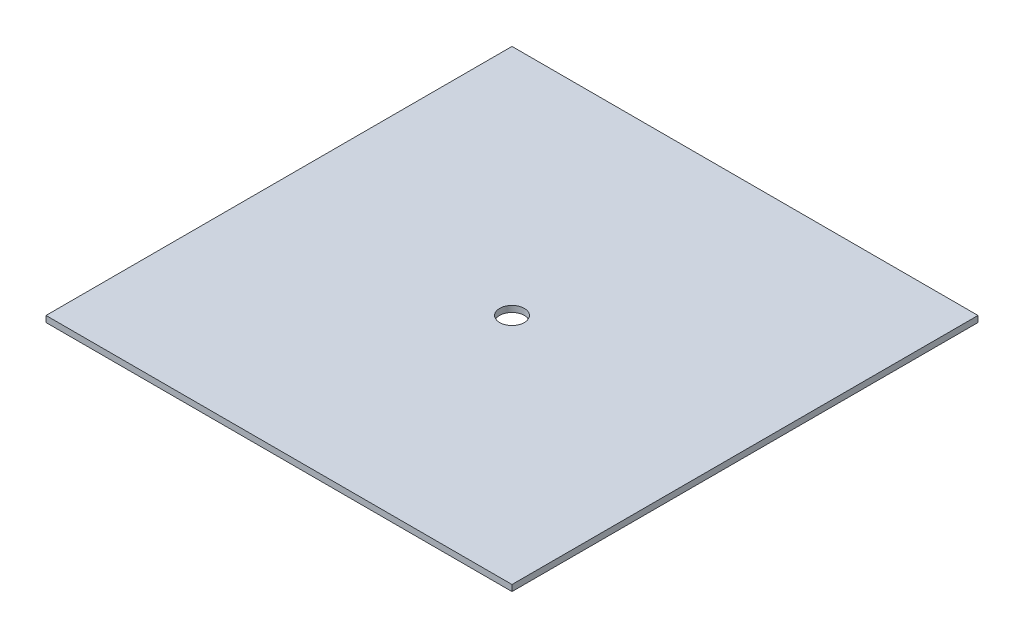
ISO-10303-21;
HEADER;
FILE_DESCRIPTION(('STEP AP214'),'2;1');
FILE_NAME('part.step','',(''),(''),'','','');
FILE_SCHEMA(('AUTOMOTIVE_DESIGN { 1 0 10303 214 1 1 1 1 }'));
ENDSEC;
DATA;
#1=APPLICATION_CONTEXT('core data for automotive mechanical design processes');
#2=APPLICATION_PROTOCOL_DEFINITION('international standard','automotive_design',2000,#1);
#3=PRODUCT_CONTEXT('',#1,'mechanical');
#4=PRODUCT('Part','Part','',(#3));
#5=PRODUCT_RELATED_PRODUCT_CATEGORY('part','',(#4));
#6=PRODUCT_DEFINITION_FORMATION('','',#4);
#7=PRODUCT_DEFINITION_CONTEXT('part definition',#1,'design');
#8=PRODUCT_DEFINITION('design','',#6,#7);
#9=PRODUCT_DEFINITION_SHAPE('','',#8);
#10=(LENGTH_UNIT() NAMED_UNIT(*) SI_UNIT(.MILLI.,.METRE.));
#11=(NAMED_UNIT(*) PLANE_ANGLE_UNIT() SI_UNIT($,.RADIAN.));
#12=(NAMED_UNIT(*) SI_UNIT($,.STERADIAN.) SOLID_ANGLE_UNIT());
#13=UNCERTAINTY_MEASURE_WITH_UNIT(LENGTH_MEASURE(1.E-05),#10,'distance_accuracy_value','');
#14=(GEOMETRIC_REPRESENTATION_CONTEXT(3) GLOBAL_UNCERTAINTY_ASSIGNED_CONTEXT((#13)) GLOBAL_UNIT_ASSIGNED_CONTEXT((#10,
#11,#12)) REPRESENTATION_CONTEXT('',''));
#15=CARTESIAN_POINT('',(0.,0.,0.));
#16=DIRECTION('',(0.,0.,1.));
#17=DIRECTION('',(1.,0.,0.));
#18=AXIS2_PLACEMENT_3D('',#15,#16,#17);
#19=CARTESIAN_POINT('',(0.,0.79375,0.));
#20=DIRECTION('',(0.,1.,0.));
#21=DIRECTION('',(0.,0.,1.));
#22=AXIS2_PLACEMENT_3D('',#19,#20,#21);
#23=PLANE('',#22);
#24=DIRECTION('',(-1.,0.,0.));
#25=VECTOR('',#24,1.);
#26=CARTESIAN_POINT('',(17.557337307224,0.79375,-30.5401810731712));
#27=LINE('',#26,#25);
#28=CARTESIAN_POINT('',(77.557337307224,0.79375,-30.5401810731712));
#29=VERTEX_POINT('',#28);
#30=CARTESIAN_POINT('',(17.557337307224,0.79375,-30.5401810731712));
#31=VERTEX_POINT('',#30);
#32=EDGE_CURVE('E91',#29,#31,#27,.T.);
#33=ORIENTED_EDGE('',*,*,#32,.T.);
#34=DIRECTION('',(0.,0.,1.));
#35=VECTOR('',#34,1.);
#36=CARTESIAN_POINT('',(17.557337307224,0.79375,-30.5401810731712));
#37=LINE('',#36,#35);
#38=CARTESIAN_POINT('',(17.557337307224,0.79375,29.4598189268288));
#39=VERTEX_POINT('',#38);
#40=EDGE_CURVE('E86',#31,#39,#37,.T.);
#41=ORIENTED_EDGE('',*,*,#40,.T.);
#42=DIRECTION('',(1.,0.,0.));
#43=VECTOR('',#42,1.);
#44=CARTESIAN_POINT('',(17.557337307224,0.79375,29.4598189268288));
#45=LINE('',#44,#43);
#46=CARTESIAN_POINT('',(77.557337307224,0.79375,29.4598189268288));
#47=VERTEX_POINT('',#46);
#48=EDGE_CURVE('E89',#39,#47,#45,.T.);
#49=ORIENTED_EDGE('',*,*,#48,.T.);
#50=DIRECTION('',(0.,0.,-1.));
#51=VECTOR('',#50,1.);
#52=CARTESIAN_POINT('',(77.557337307224,0.79375,29.4598189268288));
#53=LINE('',#52,#51);
#54=EDGE_CURVE('E56',#47,#29,#53,.T.);
#55=ORIENTED_EDGE('',*,*,#54,.T.);
#56=EDGE_LOOP('',(#33,#41,#49,#55));
#57=FACE_BOUND('',#56,.T.);
#58=CARTESIAN_POINT('',(47.557337307224,0.79375,-0.540181073171234));
#59=DIRECTION('',(0.,1.,0.));
#60=DIRECTION('',(0.,0.,1.));
#61=AXIS2_PLACEMENT_3D('',#58,#59,#60);
#62=CIRCLE('',#61,1.5875);
#63=CARTESIAN_POINT('',(47.557337307224,0.79375,1.04731892682877));
#64=VERTEX_POINT('',#63);
#65=EDGE_CURVE('E106',#64,#64,#62,.T.);
#66=ORIENTED_EDGE('',*,*,#65,.F.);
#67=EDGE_LOOP('',(#66));
#68=FACE_BOUND('',#67,.T.);
#69=ADVANCED_FACE('F39',(#57,#68),#23,.T.);
#70=CARTESIAN_POINT('',(0.,0.,0.));
#71=DIRECTION('',(0.,1.,0.));
#72=DIRECTION('',(0.,0.,1.));
#73=AXIS2_PLACEMENT_3D('',#70,#71,#72);
#74=PLANE('',#73);
#75=DIRECTION('',(-1.,0.,0.));
#76=VECTOR('',#75,1.);
#77=CARTESIAN_POINT('',(17.557337307224,0.,-30.5401810731712));
#78=LINE('',#77,#76);
#79=CARTESIAN_POINT('',(77.557337307224,0.,-30.5401810731712));
#80=VERTEX_POINT('',#79);
#81=CARTESIAN_POINT('',(17.557337307224,0.,-30.5401810731712));
#82=VERTEX_POINT('',#81);
#83=EDGE_CURVE('E103',#80,#82,#78,.T.);
#84=ORIENTED_EDGE('',*,*,#83,.F.);
#85=DIRECTION('',(0.,0.,-1.));
#86=VECTOR('',#85,1.);
#87=CARTESIAN_POINT('',(77.557337307224,0.,29.4598189268288));
#88=LINE('',#87,#86);
#89=CARTESIAN_POINT('',(77.557337307224,0.,29.4598189268288));
#90=VERTEX_POINT('',#89);
#91=EDGE_CURVE('E79',#90,#80,#88,.T.);
#92=ORIENTED_EDGE('',*,*,#91,.F.);
#93=DIRECTION('',(1.,0.,0.));
#94=VECTOR('',#93,1.);
#95=CARTESIAN_POINT('',(17.557337307224,0.,29.4598189268288));
#96=LINE('',#95,#94);
#97=CARTESIAN_POINT('',(17.557337307224,0.,29.4598189268288));
#98=VERTEX_POINT('',#97);
#99=EDGE_CURVE('E73',#98,#90,#96,.T.);
#100=ORIENTED_EDGE('',*,*,#99,.F.);
#101=DIRECTION('',(0.,0.,1.));
#102=VECTOR('',#101,1.);
#103=CARTESIAN_POINT('',(17.557337307224,0.,-30.5401810731712));
#104=LINE('',#103,#102);
#105=EDGE_CURVE('E95',#82,#98,#104,.T.);
#106=ORIENTED_EDGE('',*,*,#105,.F.);
#107=EDGE_LOOP('',(#84,#92,#100,#106));
#108=FACE_BOUND('',#107,.T.);
#109=CARTESIAN_POINT('',(47.557337307224,0.,-0.540181073171234));
#110=DIRECTION('',(0.,1.,0.));
#111=DIRECTION('',(0.,0.,1.));
#112=AXIS2_PLACEMENT_3D('',#109,#110,#111);
#113=CIRCLE('',#112,1.5875);
#114=CARTESIAN_POINT('',(47.557337307224,0.,1.04731892682877));
#115=VERTEX_POINT('',#114);
#116=EDGE_CURVE('E118',#115,#115,#113,.T.);
#117=ORIENTED_EDGE('',*,*,#116,.T.);
#118=EDGE_LOOP('',(#117));
#119=FACE_BOUND('',#118,.T.);
#120=ADVANCED_FACE('F114',(#108,#119),#74,.F.);
#121=CARTESIAN_POINT('',(17.557337307224,0.79375,-30.5401810731712));
#122=DIRECTION('',(0.,0.,1.));
#123=DIRECTION('',(1.,0.,0.));
#124=AXIS2_PLACEMENT_3D('',#121,#122,#123);
#125=PLANE('',#124);
#126=ORIENTED_EDGE('',*,*,#83,.T.);
#127=DIRECTION('',(0.,-1.,0.));
#128=VECTOR('',#127,1.);
#129=CARTESIAN_POINT('',(17.557337307224,0.79375,-30.5401810731712));
#130=LINE('',#129,#128);
#131=EDGE_CURVE('E11',#31,#82,#130,.T.);
#132=ORIENTED_EDGE('',*,*,#131,.F.);
#133=ORIENTED_EDGE('',*,*,#32,.F.);
#134=DIRECTION('',(0.,-1.,0.));
#135=VECTOR('',#134,1.);
#136=CARTESIAN_POINT('',(77.557337307224,0.79375,-30.5401810731712));
#137=LINE('',#136,#135);
#138=EDGE_CURVE('E99',#29,#80,#137,.T.);
#139=ORIENTED_EDGE('',*,*,#138,.T.);
#140=EDGE_LOOP('',(#126,#132,#133,#139));
#141=FACE_BOUND('',#140,.T.);
#142=ADVANCED_FACE('F41',(#141),#125,.F.);
#143=CARTESIAN_POINT('',(17.557337307224,0.79375,-30.5401810731712));
#144=DIRECTION('',(1.,0.,0.));
#145=DIRECTION('',(0.,0.,-1.));
#146=AXIS2_PLACEMENT_3D('',#143,#144,#145);
#147=PLANE('',#146);
#148=ORIENTED_EDGE('',*,*,#105,.T.);
#149=DIRECTION('',(0.,-1.,0.));
#150=VECTOR('',#149,1.);
#151=CARTESIAN_POINT('',(17.557337307224,0.79375,29.4598189268288));
#152=LINE('',#151,#150);
#153=EDGE_CURVE('E48',#39,#98,#152,.T.);
#154=ORIENTED_EDGE('',*,*,#153,.F.);
#155=ORIENTED_EDGE('',*,*,#40,.F.);
#156=ORIENTED_EDGE('',*,*,#131,.T.);
#157=EDGE_LOOP('',(#148,#154,#155,#156));
#158=FACE_BOUND('',#157,.T.);
#159=ADVANCED_FACE('F94',(#158),#147,.F.);
#160=CARTESIAN_POINT('',(17.557337307224,0.79375,29.4598189268288));
#161=DIRECTION('',(0.,0.,-1.));
#162=DIRECTION('',(-1.,0.,0.));
#163=AXIS2_PLACEMENT_3D('',#160,#161,#162);
#164=PLANE('',#163);
#165=ORIENTED_EDGE('',*,*,#99,.T.);
#166=DIRECTION('',(0.,-1.,0.));
#167=VECTOR('',#166,1.);
#168=CARTESIAN_POINT('',(77.557337307224,0.79375,29.4598189268288));
#169=LINE('',#168,#167);
#170=EDGE_CURVE('E96',#47,#90,#169,.T.);
#171=ORIENTED_EDGE('',*,*,#170,.F.);
#172=ORIENTED_EDGE('',*,*,#48,.F.);
#173=ORIENTED_EDGE('',*,*,#153,.T.);
#174=EDGE_LOOP('',(#165,#171,#172,#173));
#175=FACE_BOUND('',#174,.T.);
#176=ADVANCED_FACE('F97',(#175),#164,.F.);
#177=CARTESIAN_POINT('',(77.557337307224,0.79375,29.4598189268288));
#178=DIRECTION('',(-1.,0.,0.));
#179=DIRECTION('',(0.,0.,1.));
#180=AXIS2_PLACEMENT_3D('',#177,#178,#179);
#181=PLANE('',#180);
#182=ORIENTED_EDGE('',*,*,#91,.T.);
#183=ORIENTED_EDGE('',*,*,#138,.F.);
#184=ORIENTED_EDGE('',*,*,#54,.F.);
#185=ORIENTED_EDGE('',*,*,#170,.T.);
#186=EDGE_LOOP('',(#182,#183,#184,#185));
#187=FACE_BOUND('',#186,.T.);
#188=ADVANCED_FACE('F111',(#187),#181,.F.);
#189=CARTESIAN_POINT('',(47.557337307224,0.79375,-0.540181073171234));
#190=DIRECTION('',(0.,-1.,0.));
#191=DIRECTION('',(0.,0.,-1.));
#192=AXIS2_PLACEMENT_3D('',#189,#190,#191);
#193=CYLINDRICAL_SURFACE('',#192,1.5875);
#194=ORIENTED_EDGE('',*,*,#65,.T.);
#195=EDGE_LOOP('',(#194));
#196=FACE_BOUND('',#195,.T.);
#197=ORIENTED_EDGE('',*,*,#116,.F.);
#198=EDGE_LOOP('',(#197));
#199=FACE_BOUND('',#198,.T.);
#200=ADVANCED_FACE('F124',(#196,#199),#193,.F.);
#201=CLOSED_SHELL('',(#69,#120,#142,#159,#176,#188,#200));
#202=MANIFOLD_SOLID_BREP('B2',#201);
#203=ADVANCED_BREP_SHAPE_REPRESENTATION('',(#18,#202),#14);
#204=SHAPE_DEFINITION_REPRESENTATION(#9,#203);
ENDSEC;
END-ISO-10303-21;
